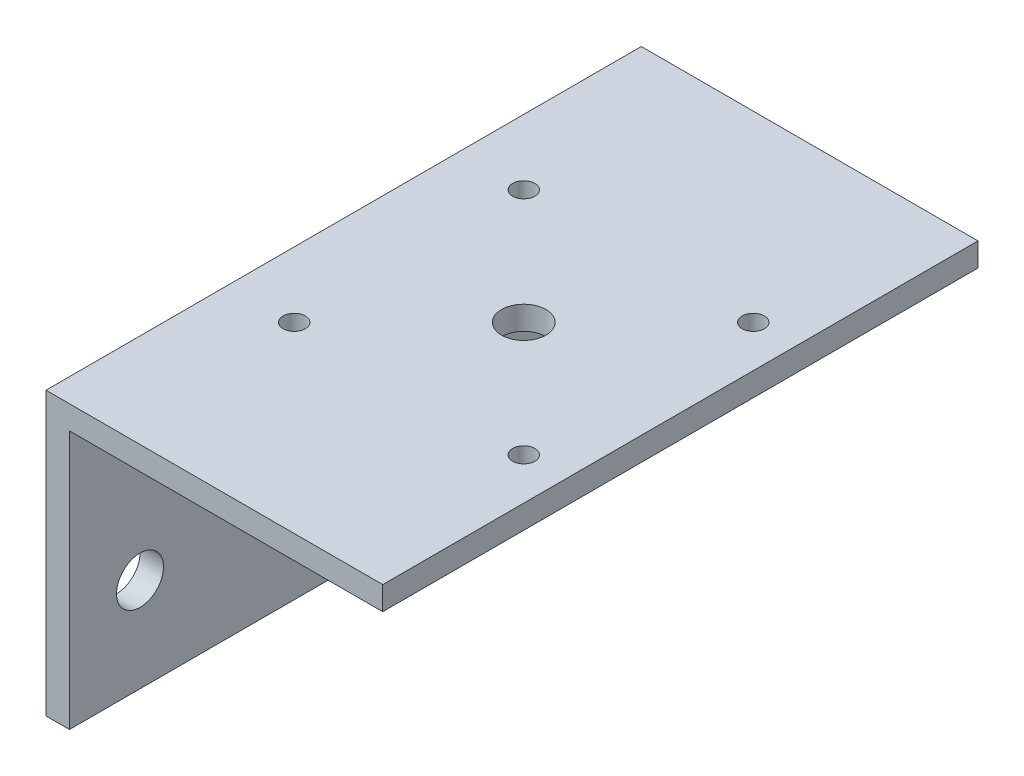
ISO-10303-21;
HEADER;
FILE_DESCRIPTION(('STEP AP214'),'2;1');
FILE_NAME('part.step','',(''),(''),'','','');
FILE_SCHEMA(('AUTOMOTIVE_DESIGN { 1 0 10303 214 1 1 1 1 }'));
ENDSEC;
DATA;
#1=APPLICATION_CONTEXT('core data for automotive mechanical design processes');
#2=APPLICATION_PROTOCOL_DEFINITION('international standard','automotive_design',2000,#1);
#3=PRODUCT_CONTEXT('',#1,'mechanical');
#4=PRODUCT('Part','Part','',(#3));
#5=PRODUCT_RELATED_PRODUCT_CATEGORY('part','',(#4));
#6=PRODUCT_DEFINITION_FORMATION('','',#4);
#7=PRODUCT_DEFINITION_CONTEXT('part definition',#1,'design');
#8=PRODUCT_DEFINITION('design','',#6,#7);
#9=PRODUCT_DEFINITION_SHAPE('','',#8);
#10=(LENGTH_UNIT() NAMED_UNIT(*) SI_UNIT(.MILLI.,.METRE.));
#11=(NAMED_UNIT(*) PLANE_ANGLE_UNIT() SI_UNIT($,.RADIAN.));
#12=(NAMED_UNIT(*) SI_UNIT($,.STERADIAN.) SOLID_ANGLE_UNIT());
#13=UNCERTAINTY_MEASURE_WITH_UNIT(LENGTH_MEASURE(1.E-05),#10,'distance_accuracy_value','');
#14=(GEOMETRIC_REPRESENTATION_CONTEXT(3) GLOBAL_UNCERTAINTY_ASSIGNED_CONTEXT((#13)) GLOBAL_UNIT_ASSIGNED_CONTEXT((#10,
#11,#12)) REPRESENTATION_CONTEXT('',''));
#15=CARTESIAN_POINT('',(0.,0.,0.));
#16=DIRECTION('',(0.,0.,1.));
#17=DIRECTION('',(1.,0.,0.));
#18=AXIS2_PLACEMENT_3D('',#15,#16,#17);
#19=CARTESIAN_POINT('',(0.,0.,80.4));
#20=DIRECTION('',(1.,0.,0.));
#21=DIRECTION('',(0.,0.,-1.));
#22=AXIS2_PLACEMENT_3D('',#19,#20,#21);
#23=PLANE('',#22);
#24=CARTESIAN_POINT('',(0.,12.7,9.52500000000001));
#25=DIRECTION('',(1.,0.,0.));
#26=DIRECTION('',(0.,0.,-1.));
#27=AXIS2_PLACEMENT_3D('',#24,#25,#26);
#28=CIRCLE('',#27,3.175);
#29=CARTESIAN_POINT('',(0.,12.7,6.35000000000001));
#30=VERTEX_POINT('',#29);
#31=EDGE_CURVE('E162',#30,#30,#28,.T.);
#32=ORIENTED_EDGE('',*,*,#31,.T.);
#33=EDGE_LOOP('',(#32));
#34=FACE_BOUND('',#33,.T.);
#35=CARTESIAN_POINT('',(0.,12.7,70.875));
#36=DIRECTION('',(1.,0.,0.));
#37=DIRECTION('',(0.,0.,-1.));
#38=AXIS2_PLACEMENT_3D('',#35,#36,#37);
#39=CIRCLE('',#38,3.175);
#40=CARTESIAN_POINT('',(0.,12.7,67.7));
#41=VERTEX_POINT('',#40);
#42=EDGE_CURVE('E120',#41,#41,#39,.T.);
#43=ORIENTED_EDGE('',*,*,#42,.T.);
#44=EDGE_LOOP('',(#43));
#45=FACE_BOUND('',#44,.T.);
#46=DIRECTION('',(0.,-1.,0.));
#47=VECTOR('',#46,1.);
#48=CARTESIAN_POINT('',(0.,0.,0.));
#49=LINE('',#48,#47);
#50=CARTESIAN_POINT('',(0.,38.1,0.));
#51=VERTEX_POINT('',#50);
#52=CARTESIAN_POINT('',(0.,0.,0.));
#53=VERTEX_POINT('',#52);
#54=EDGE_CURVE('E116',#51,#53,#49,.T.);
#55=ORIENTED_EDGE('',*,*,#54,.T.);
#56=DIRECTION('',(0.,0.,-1.));
#57=VECTOR('',#56,1.);
#58=CARTESIAN_POINT('',(0.,0.,80.4));
#59=LINE('',#58,#57);
#60=CARTESIAN_POINT('',(0.,0.,80.4));
#61=VERTEX_POINT('',#60);
#62=EDGE_CURVE('E11',#61,#53,#59,.T.);
#63=ORIENTED_EDGE('',*,*,#62,.F.);
#64=DIRECTION('',(0.,-1.,0.));
#65=VECTOR('',#64,1.);
#66=CARTESIAN_POINT('',(0.,0.,80.4));
#67=LINE('',#66,#65);
#68=CARTESIAN_POINT('',(0.,38.1,80.4));
#69=VERTEX_POINT('',#68);
#70=EDGE_CURVE('E127',#69,#61,#67,.T.);
#71=ORIENTED_EDGE('',*,*,#70,.F.);
#72=DIRECTION('',(0.,0.,-1.));
#73=VECTOR('',#72,1.);
#74=CARTESIAN_POINT('',(0.,38.1,80.4));
#75=LINE('',#74,#73);
#76=EDGE_CURVE('E112',#69,#51,#75,.T.);
#77=ORIENTED_EDGE('',*,*,#76,.T.);
#78=EDGE_LOOP('',(#55,#63,#71,#77));
#79=FACE_BOUND('',#78,.T.);
#80=ADVANCED_FACE('F32',(#34,#45,#79),#23,.F.);
#81=CARTESIAN_POINT('',(0.,0.,80.4));
#82=DIRECTION('',(0.,1.,0.));
#83=DIRECTION('',(-1.,0.,0.));
#84=AXIS2_PLACEMENT_3D('',#81,#82,#83);
#85=PLANE('',#84);
#86=DIRECTION('',(1.,0.,0.));
#87=VECTOR('',#86,1.);
#88=CARTESIAN_POINT('',(0.,0.,0.));
#89=LINE('',#88,#87);
#90=CARTESIAN_POINT('',(3.175,0.,0.));
#91=VERTEX_POINT('',#90);
#92=EDGE_CURVE('E119',#53,#91,#89,.T.);
#93=ORIENTED_EDGE('',*,*,#92,.T.);
#94=DIRECTION('',(0.,0.,-1.));
#95=VECTOR('',#94,1.);
#96=CARTESIAN_POINT('',(3.175,0.,80.4));
#97=LINE('',#96,#95);
#98=CARTESIAN_POINT('',(3.175,0.,80.4));
#99=VERTEX_POINT('',#98);
#100=EDGE_CURVE('E40',#99,#91,#97,.T.);
#101=ORIENTED_EDGE('',*,*,#100,.F.);
#102=DIRECTION('',(1.,0.,0.));
#103=VECTOR('',#102,1.);
#104=CARTESIAN_POINT('',(0.,0.,80.4));
#105=LINE('',#104,#103);
#106=EDGE_CURVE('E85',#61,#99,#105,.T.);
#107=ORIENTED_EDGE('',*,*,#106,.F.);
#108=ORIENTED_EDGE('',*,*,#62,.T.);
#109=EDGE_LOOP('',(#93,#101,#107,#108));
#110=FACE_BOUND('',#109,.T.);
#111=ADVANCED_FACE('F154',(#110),#85,.F.);
#112=CARTESIAN_POINT('',(3.175,0.,80.4));
#113=DIRECTION('',(-1.,0.,0.));
#114=DIRECTION('',(0.,0.,1.));
#115=AXIS2_PLACEMENT_3D('',#112,#113,#114);
#116=PLANE('',#115);
#117=CARTESIAN_POINT('',(3.175,12.7,9.52500000000001));
#118=DIRECTION('',(1.,0.,0.));
#119=DIRECTION('',(0.,0.,-1.));
#120=AXIS2_PLACEMENT_3D('',#117,#118,#119);
#121=CIRCLE('',#120,3.175);
#122=CARTESIAN_POINT('',(3.175,12.7,6.35000000000001));
#123=VERTEX_POINT('',#122);
#124=EDGE_CURVE('E171',#123,#123,#121,.T.);
#125=ORIENTED_EDGE('',*,*,#124,.F.);
#126=EDGE_LOOP('',(#125));
#127=FACE_BOUND('',#126,.T.);
#128=CARTESIAN_POINT('',(3.175,12.7,70.875));
#129=DIRECTION('',(1.,0.,0.));
#130=DIRECTION('',(0.,0.,-1.));
#131=AXIS2_PLACEMENT_3D('',#128,#129,#130);
#132=CIRCLE('',#131,3.175);
#133=CARTESIAN_POINT('',(3.175,12.7,67.7));
#134=VERTEX_POINT('',#133);
#135=EDGE_CURVE('E166',#134,#134,#132,.T.);
#136=ORIENTED_EDGE('',*,*,#135,.F.);
#137=EDGE_LOOP('',(#136));
#138=FACE_BOUND('',#137,.T.);
#139=DIRECTION('',(0.,1.,0.));
#140=VECTOR('',#139,1.);
#141=CARTESIAN_POINT('',(3.175,0.,0.));
#142=LINE('',#141,#140);
#143=CARTESIAN_POINT('',(3.175,34.925,0.));
#144=VERTEX_POINT('',#143);
#145=EDGE_CURVE('E122',#91,#144,#142,.T.);
#146=ORIENTED_EDGE('',*,*,#145,.T.);
#147=DIRECTION('',(0.,0.,-1.));
#148=VECTOR('',#147,1.);
#149=CARTESIAN_POINT('',(3.175,34.925,80.4));
#150=LINE('',#149,#148);
#151=CARTESIAN_POINT('',(3.175,34.925,80.4));
#152=VERTEX_POINT('',#151);
#153=EDGE_CURVE('E107',#152,#144,#150,.T.);
#154=ORIENTED_EDGE('',*,*,#153,.F.);
#155=DIRECTION('',(0.,1.,0.));
#156=VECTOR('',#155,1.);
#157=CARTESIAN_POINT('',(3.175,0.,80.4));
#158=LINE('',#157,#156);
#159=EDGE_CURVE('E98',#99,#152,#158,.T.);
#160=ORIENTED_EDGE('',*,*,#159,.F.);
#161=ORIENTED_EDGE('',*,*,#100,.T.);
#162=EDGE_LOOP('',(#146,#154,#160,#161));
#163=FACE_BOUND('',#162,.T.);
#164=ADVANCED_FACE('F133',(#127,#138,#163),#116,.F.);
#165=CARTESIAN_POINT('',(45.475,34.925,80.4));
#166=DIRECTION('',(0.,1.,0.));
#167=DIRECTION('',(0.,0.,1.));
#168=AXIS2_PLACEMENT_3D('',#165,#166,#167);
#169=PLANE('',#168);
#170=CARTESIAN_POINT('',(24.325,34.925,40.2));
#171=DIRECTION('',(0.,1.,0.));
#172=DIRECTION('',(0.,0.,1.));
#173=AXIS2_PLACEMENT_3D('',#170,#171,#172);
#174=CIRCLE('',#173,3.);
#175=CARTESIAN_POINT('',(24.325,34.925,43.2));
#176=VERTEX_POINT('',#175);
#177=EDGE_CURVE('E201',#176,#176,#174,.T.);
#178=ORIENTED_EDGE('',*,*,#177,.T.);
#179=EDGE_LOOP('',(#178));
#180=FACE_BOUND('',#179,.T.);
#181=CARTESIAN_POINT('',(39.825,34.925,24.7));
#182=DIRECTION('',(0.,1.,0.));
#183=DIRECTION('',(0.,0.,1.));
#184=AXIS2_PLACEMENT_3D('',#181,#182,#183);
#185=CIRCLE('',#184,1.5);
#186=CARTESIAN_POINT('',(39.825,34.925,26.2));
#187=VERTEX_POINT('',#186);
#188=EDGE_CURVE('E195',#187,#187,#185,.T.);
#189=ORIENTED_EDGE('',*,*,#188,.T.);
#190=EDGE_LOOP('',(#189));
#191=FACE_BOUND('',#190,.T.);
#192=CARTESIAN_POINT('',(8.825,34.925,24.7));
#193=DIRECTION('',(0.,1.,0.));
#194=DIRECTION('',(0.,0.,1.));
#195=AXIS2_PLACEMENT_3D('',#192,#193,#194);
#196=CIRCLE('',#195,1.5);
#197=CARTESIAN_POINT('',(8.825,34.925,26.2));
#198=VERTEX_POINT('',#197);
#199=EDGE_CURVE('E189',#198,#198,#196,.T.);
#200=ORIENTED_EDGE('',*,*,#199,.T.);
#201=EDGE_LOOP('',(#200));
#202=FACE_BOUND('',#201,.T.);
#203=CARTESIAN_POINT('',(8.82500000000001,34.925,55.7));
#204=DIRECTION('',(0.,1.,0.));
#205=DIRECTION('',(0.,0.,1.));
#206=AXIS2_PLACEMENT_3D('',#203,#204,#205);
#207=CIRCLE('',#206,1.5);
#208=CARTESIAN_POINT('',(8.82500000000001,34.925,57.2));
#209=VERTEX_POINT('',#208);
#210=EDGE_CURVE('E183',#209,#209,#207,.T.);
#211=ORIENTED_EDGE('',*,*,#210,.T.);
#212=EDGE_LOOP('',(#211));
#213=FACE_BOUND('',#212,.T.);
#214=CARTESIAN_POINT('',(39.825,34.925,55.7));
#215=DIRECTION('',(0.,1.,0.));
#216=DIRECTION('',(0.,0.,1.));
#217=AXIS2_PLACEMENT_3D('',#214,#215,#216);
#218=CIRCLE('',#217,1.5);
#219=CARTESIAN_POINT('',(39.825,34.925,57.2));
#220=VERTEX_POINT('',#219);
#221=EDGE_CURVE('E176',#220,#220,#218,.T.);
#222=ORIENTED_EDGE('',*,*,#221,.T.);
#223=EDGE_LOOP('',(#222));
#224=FACE_BOUND('',#223,.T.);
#225=DIRECTION('',(1.,0.,0.));
#226=VECTOR('',#225,1.);
#227=CARTESIAN_POINT('',(45.475,34.925,0.));
#228=LINE('',#227,#226);
#229=CARTESIAN_POINT('',(45.475,34.925,0.));
#230=VERTEX_POINT('',#229);
#231=EDGE_CURVE('E106',#144,#230,#228,.T.);
#232=ORIENTED_EDGE('',*,*,#231,.T.);
#233=DIRECTION('',(0.,0.,-1.));
#234=VECTOR('',#233,1.);
#235=CARTESIAN_POINT('',(45.475,34.925,80.4));
#236=LINE('',#235,#234);
#237=CARTESIAN_POINT('',(45.475,34.925,80.4));
#238=VERTEX_POINT('',#237);
#239=EDGE_CURVE('E103',#238,#230,#236,.T.);
#240=ORIENTED_EDGE('',*,*,#239,.F.);
#241=DIRECTION('',(1.,0.,0.));
#242=VECTOR('',#241,1.);
#243=CARTESIAN_POINT('',(45.475,34.925,80.4));
#244=LINE('',#243,#242);
#245=EDGE_CURVE('E92',#152,#238,#244,.T.);
#246=ORIENTED_EDGE('',*,*,#245,.F.);
#247=ORIENTED_EDGE('',*,*,#153,.T.);
#248=EDGE_LOOP('',(#232,#240,#246,#247));
#249=FACE_BOUND('',#248,.T.);
#250=ADVANCED_FACE('F104',(#180,#191,#202,#213,#224,#249),#169,.F.);
#251=CARTESIAN_POINT('',(45.475,34.925,80.4));
#252=DIRECTION('',(-1.,0.,0.));
#253=DIRECTION('',(0.,0.,1.));
#254=AXIS2_PLACEMENT_3D('',#251,#252,#253);
#255=PLANE('',#254);
#256=DIRECTION('',(0.,1.,0.));
#257=VECTOR('',#256,1.);
#258=CARTESIAN_POINT('',(45.475,34.925,0.));
#259=LINE('',#258,#257);
#260=CARTESIAN_POINT('',(45.475,38.1,0.));
#261=VERTEX_POINT('',#260);
#262=EDGE_CURVE('E71',#230,#261,#259,.T.);
#263=ORIENTED_EDGE('',*,*,#262,.T.);
#264=DIRECTION('',(0.,0.,-1.));
#265=VECTOR('',#264,1.);
#266=CARTESIAN_POINT('',(45.475,38.1,80.4));
#267=LINE('',#266,#265);
#268=CARTESIAN_POINT('',(45.475,38.1,80.4));
#269=VERTEX_POINT('',#268);
#270=EDGE_CURVE('E108',#269,#261,#267,.T.);
#271=ORIENTED_EDGE('',*,*,#270,.F.);
#272=DIRECTION('',(0.,1.,0.));
#273=VECTOR('',#272,1.);
#274=CARTESIAN_POINT('',(45.475,34.925,80.4));
#275=LINE('',#274,#273);
#276=EDGE_CURVE('E96',#238,#269,#275,.T.);
#277=ORIENTED_EDGE('',*,*,#276,.F.);
#278=ORIENTED_EDGE('',*,*,#239,.T.);
#279=EDGE_LOOP('',(#263,#271,#277,#278));
#280=FACE_BOUND('',#279,.T.);
#281=ADVANCED_FACE('F110',(#280),#255,.F.);
#282=CARTESIAN_POINT('',(0.,38.1,80.4));
#283=DIRECTION('',(0.,-1.,0.));
#284=DIRECTION('',(0.,0.,-1.));
#285=AXIS2_PLACEMENT_3D('',#282,#283,#284);
#286=PLANE('',#285);
#287=CARTESIAN_POINT('',(24.325,38.1,40.2));
#288=DIRECTION('',(0.,1.,0.));
#289=DIRECTION('',(0.,0.,1.));
#290=AXIS2_PLACEMENT_3D('',#287,#288,#289);
#291=CIRCLE('',#290,3.);
#292=CARTESIAN_POINT('',(24.325,38.1,43.2));
#293=VERTEX_POINT('',#292);
#294=EDGE_CURVE('E204',#293,#293,#291,.T.);
#295=ORIENTED_EDGE('',*,*,#294,.F.);
#296=EDGE_LOOP('',(#295));
#297=FACE_BOUND('',#296,.T.);
#298=CARTESIAN_POINT('',(39.825,38.1,24.7));
#299=DIRECTION('',(0.,1.,0.));
#300=DIRECTION('',(0.,0.,1.));
#301=AXIS2_PLACEMENT_3D('',#298,#299,#300);
#302=CIRCLE('',#301,1.5);
#303=CARTESIAN_POINT('',(39.825,38.1,26.2));
#304=VERTEX_POINT('',#303);
#305=EDGE_CURVE('E198',#304,#304,#302,.T.);
#306=ORIENTED_EDGE('',*,*,#305,.F.);
#307=EDGE_LOOP('',(#306));
#308=FACE_BOUND('',#307,.T.);
#309=CARTESIAN_POINT('',(8.825,38.1,24.7));
#310=DIRECTION('',(0.,1.,0.));
#311=DIRECTION('',(0.,0.,1.));
#312=AXIS2_PLACEMENT_3D('',#309,#310,#311);
#313=CIRCLE('',#312,1.5);
#314=CARTESIAN_POINT('',(8.825,38.1,26.2));
#315=VERTEX_POINT('',#314);
#316=EDGE_CURVE('E192',#315,#315,#313,.T.);
#317=ORIENTED_EDGE('',*,*,#316,.F.);
#318=EDGE_LOOP('',(#317));
#319=FACE_BOUND('',#318,.T.);
#320=CARTESIAN_POINT('',(8.82500000000001,38.1,55.7));
#321=DIRECTION('',(0.,1.,0.));
#322=DIRECTION('',(0.,0.,1.));
#323=AXIS2_PLACEMENT_3D('',#320,#321,#322);
#324=CIRCLE('',#323,1.5);
#325=CARTESIAN_POINT('',(8.82500000000001,38.1,57.2));
#326=VERTEX_POINT('',#325);
#327=EDGE_CURVE('E186',#326,#326,#324,.T.);
#328=ORIENTED_EDGE('',*,*,#327,.F.);
#329=EDGE_LOOP('',(#328));
#330=FACE_BOUND('',#329,.T.);
#331=CARTESIAN_POINT('',(39.825,38.1,55.7));
#332=DIRECTION('',(0.,1.,0.));
#333=DIRECTION('',(0.,0.,1.));
#334=AXIS2_PLACEMENT_3D('',#331,#332,#333);
#335=CIRCLE('',#334,1.5);
#336=CARTESIAN_POINT('',(39.825,38.1,57.2));
#337=VERTEX_POINT('',#336);
#338=EDGE_CURVE('E180',#337,#337,#335,.T.);
#339=ORIENTED_EDGE('',*,*,#338,.F.);
#340=EDGE_LOOP('',(#339));
#341=FACE_BOUND('',#340,.T.);
#342=DIRECTION('',(-1.,0.,0.));
#343=VECTOR('',#342,1.);
#344=CARTESIAN_POINT('',(0.,38.1,0.));
#345=LINE('',#344,#343);
#346=EDGE_CURVE('E77',#261,#51,#345,.T.);
#347=ORIENTED_EDGE('',*,*,#346,.T.);
#348=ORIENTED_EDGE('',*,*,#76,.F.);
#349=DIRECTION('',(-1.,0.,0.));
#350=VECTOR('',#349,1.);
#351=CARTESIAN_POINT('',(0.,38.1,80.4));
#352=LINE('',#351,#350);
#353=EDGE_CURVE('E48',#269,#69,#352,.T.);
#354=ORIENTED_EDGE('',*,*,#353,.F.);
#355=ORIENTED_EDGE('',*,*,#270,.T.);
#356=EDGE_LOOP('',(#347,#348,#354,#355));
#357=FACE_BOUND('',#356,.T.);
#358=ADVANCED_FACE('F140',(#297,#308,#319,#330,#341,#357),#286,.F.);
#359=CARTESIAN_POINT('',(0.,0.,80.4));
#360=DIRECTION('',(0.,0.,-1.));
#361=DIRECTION('',(-1.,0.,0.));
#362=AXIS2_PLACEMENT_3D('',#359,#360,#361);
#363=PLANE('',#362);
#364=ORIENTED_EDGE('',*,*,#70,.T.);
#365=ORIENTED_EDGE('',*,*,#106,.T.);
#366=ORIENTED_EDGE('',*,*,#159,.T.);
#367=ORIENTED_EDGE('',*,*,#245,.T.);
#368=ORIENTED_EDGE('',*,*,#276,.T.);
#369=ORIENTED_EDGE('',*,*,#353,.T.);
#370=EDGE_LOOP('',(#364,#365,#366,#367,#368,#369));
#371=FACE_BOUND('',#370,.T.);
#372=ADVANCED_FACE('F94',(#371),#363,.F.);
#373=CARTESIAN_POINT('',(0.,0.,0.));
#374=DIRECTION('',(0.,0.,-1.));
#375=DIRECTION('',(-1.,0.,0.));
#376=AXIS2_PLACEMENT_3D('',#373,#374,#375);
#377=PLANE('',#376);
#378=ORIENTED_EDGE('',*,*,#54,.F.);
#379=ORIENTED_EDGE('',*,*,#346,.F.);
#380=ORIENTED_EDGE('',*,*,#262,.F.);
#381=ORIENTED_EDGE('',*,*,#231,.F.);
#382=ORIENTED_EDGE('',*,*,#145,.F.);
#383=ORIENTED_EDGE('',*,*,#92,.F.);
#384=EDGE_LOOP('',(#378,#379,#380,#381,#382,#383));
#385=FACE_BOUND('',#384,.T.);
#386=ADVANCED_FACE('F136',(#385),#377,.T.);
#387=CARTESIAN_POINT('',(0.,12.7,70.875));
#388=DIRECTION('',(1.,0.,0.));
#389=DIRECTION('',(0.,0.,-1.));
#390=AXIS2_PLACEMENT_3D('',#387,#388,#389);
#391=CYLINDRICAL_SURFACE('',#390,3.175);
#392=ORIENTED_EDGE('',*,*,#42,.F.);
#393=EDGE_LOOP('',(#392));
#394=FACE_BOUND('',#393,.T.);
#395=ORIENTED_EDGE('',*,*,#135,.T.);
#396=EDGE_LOOP('',(#395));
#397=FACE_BOUND('',#396,.T.);
#398=ADVANCED_FACE('F238',(#394,#397),#391,.F.);
#399=CARTESIAN_POINT('',(0.,12.7,9.52500000000001));
#400=DIRECTION('',(1.,0.,0.));
#401=DIRECTION('',(0.,0.,-1.));
#402=AXIS2_PLACEMENT_3D('',#399,#400,#401);
#403=CYLINDRICAL_SURFACE('',#402,3.175);
#404=ORIENTED_EDGE('',*,*,#31,.F.);
#405=EDGE_LOOP('',(#404));
#406=FACE_BOUND('',#405,.T.);
#407=ORIENTED_EDGE('',*,*,#124,.T.);
#408=EDGE_LOOP('',(#407));
#409=FACE_BOUND('',#408,.T.);
#410=ADVANCED_FACE('F228',(#406,#409),#403,.F.);
#411=CARTESIAN_POINT('',(39.825,0.,55.7));
#412=DIRECTION('',(0.,1.,0.));
#413=DIRECTION('',(0.,0.,1.));
#414=AXIS2_PLACEMENT_3D('',#411,#412,#413);
#415=CYLINDRICAL_SURFACE('',#414,1.5);
#416=ORIENTED_EDGE('',*,*,#338,.T.);
#417=EDGE_LOOP('',(#416));
#418=FACE_BOUND('',#417,.T.);
#419=ORIENTED_EDGE('',*,*,#221,.F.);
#420=EDGE_LOOP('',(#419));
#421=FACE_BOUND('',#420,.T.);
#422=ADVANCED_FACE('F225',(#418,#421),#415,.F.);
#423=CARTESIAN_POINT('',(8.82500000000001,0.,55.7));
#424=DIRECTION('',(0.,1.,0.));
#425=DIRECTION('',(0.,0.,1.));
#426=AXIS2_PLACEMENT_3D('',#423,#424,#425);
#427=CYLINDRICAL_SURFACE('',#426,1.5);
#428=ORIENTED_EDGE('',*,*,#327,.T.);
#429=EDGE_LOOP('',(#428));
#430=FACE_BOUND('',#429,.T.);
#431=ORIENTED_EDGE('',*,*,#210,.F.);
#432=EDGE_LOOP('',(#431));
#433=FACE_BOUND('',#432,.T.);
#434=ADVANCED_FACE('F227',(#430,#433),#427,.F.);
#435=CARTESIAN_POINT('',(8.825,0.,24.7));
#436=DIRECTION('',(0.,1.,0.));
#437=DIRECTION('',(0.,0.,1.));
#438=AXIS2_PLACEMENT_3D('',#435,#436,#437);
#439=CYLINDRICAL_SURFACE('',#438,1.5);
#440=ORIENTED_EDGE('',*,*,#316,.T.);
#441=EDGE_LOOP('',(#440));
#442=FACE_BOUND('',#441,.T.);
#443=ORIENTED_EDGE('',*,*,#199,.F.);
#444=EDGE_LOOP('',(#443));
#445=FACE_BOUND('',#444,.T.);
#446=ADVANCED_FACE('F235',(#442,#445),#439,.F.);
#447=CARTESIAN_POINT('',(39.825,0.,24.7));
#448=DIRECTION('',(0.,1.,0.));
#449=DIRECTION('',(0.,0.,1.));
#450=AXIS2_PLACEMENT_3D('',#447,#448,#449);
#451=CYLINDRICAL_SURFACE('',#450,1.5);
#452=ORIENTED_EDGE('',*,*,#305,.T.);
#453=EDGE_LOOP('',(#452));
#454=FACE_BOUND('',#453,.T.);
#455=ORIENTED_EDGE('',*,*,#188,.F.);
#456=EDGE_LOOP('',(#455));
#457=FACE_BOUND('',#456,.T.);
#458=ADVANCED_FACE('F210',(#454,#457),#451,.F.);
#459=CARTESIAN_POINT('',(24.325,0.,40.2));
#460=DIRECTION('',(0.,1.,0.));
#461=DIRECTION('',(0.,0.,1.));
#462=AXIS2_PLACEMENT_3D('',#459,#460,#461);
#463=CYLINDRICAL_SURFACE('',#462,3.);
#464=ORIENTED_EDGE('',*,*,#294,.T.);
#465=EDGE_LOOP('',(#464));
#466=FACE_BOUND('',#465,.T.);
#467=ORIENTED_EDGE('',*,*,#177,.F.);
#468=EDGE_LOOP('',(#467));
#469=FACE_BOUND('',#468,.T.);
#470=ADVANCED_FACE('F207',(#466,#469),#463,.F.);
#471=CLOSED_SHELL('',(#80,#111,#164,#250,#281,#358,#372,#386,#398,#410,#422,#434,#446,#458,#470));
#472=MANIFOLD_SOLID_BREP('B2',#471);
#473=ADVANCED_BREP_SHAPE_REPRESENTATION('',(#18,#472),#14);
#474=SHAPE_DEFINITION_REPRESENTATION(#9,#473);
ENDSEC;
END-ISO-10303-21;
